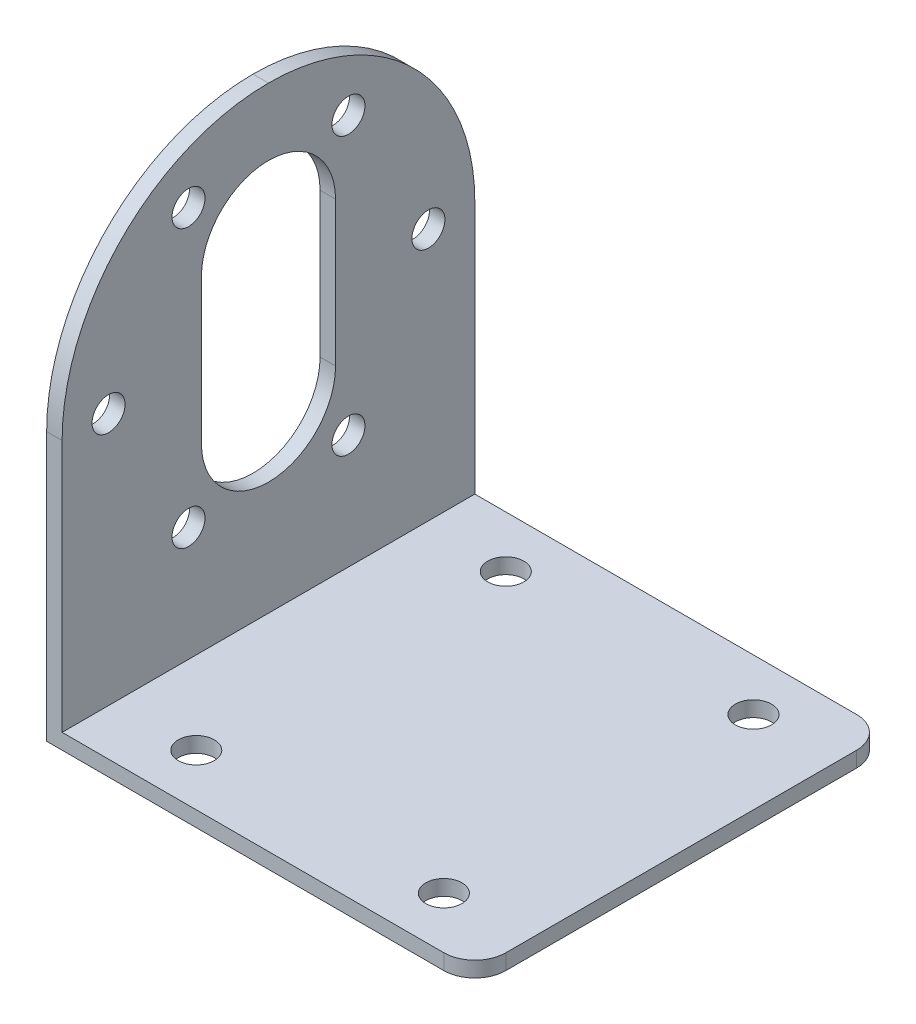
ISO-10303-21;
HEADER;
FILE_DESCRIPTION(('STEP AP214'),'2;1');
FILE_NAME('part.step','',(''),(''),'','','');
FILE_SCHEMA(('AUTOMOTIVE_DESIGN { 1 0 10303 214 1 1 1 1 }'));
ENDSEC;
DATA;
#1=APPLICATION_CONTEXT('core data for automotive mechanical design processes');
#2=APPLICATION_PROTOCOL_DEFINITION('international standard','automotive_design',2000,#1);
#3=PRODUCT_CONTEXT('',#1,'mechanical');
#4=PRODUCT('Part','Part','',(#3));
#5=PRODUCT_RELATED_PRODUCT_CATEGORY('part','',(#4));
#6=PRODUCT_DEFINITION_FORMATION('','',#4);
#7=PRODUCT_DEFINITION_CONTEXT('part definition',#1,'design');
#8=PRODUCT_DEFINITION('design','',#6,#7);
#9=PRODUCT_DEFINITION_SHAPE('','',#8);
#10=(LENGTH_UNIT() NAMED_UNIT(*) SI_UNIT(.MILLI.,.METRE.));
#11=(NAMED_UNIT(*) PLANE_ANGLE_UNIT() SI_UNIT($,.RADIAN.));
#12=(NAMED_UNIT(*) SI_UNIT($,.STERADIAN.) SOLID_ANGLE_UNIT());
#13=UNCERTAINTY_MEASURE_WITH_UNIT(LENGTH_MEASURE(1.E-05),#10,'distance_accuracy_value','');
#14=(GEOMETRIC_REPRESENTATION_CONTEXT(3) GLOBAL_UNCERTAINTY_ASSIGNED_CONTEXT((#13)) GLOBAL_UNIT_ASSIGNED_CONTEXT((#10,
#11,#12)) REPRESENTATION_CONTEXT('',''));
#15=CARTESIAN_POINT('',(0.,0.,0.));
#16=DIRECTION('',(0.,0.,1.));
#17=DIRECTION('',(1.,0.,0.));
#18=AXIS2_PLACEMENT_3D('',#15,#16,#17);
#19=CARTESIAN_POINT('',(0.,1.5,0.));
#20=DIRECTION('',(0.,-1.,0.));
#21=DIRECTION('',(0.,0.,-1.));
#22=AXIS2_PLACEMENT_3D('',#19,#20,#21);
#23=PLANE('',#22);
#24=CARTESIAN_POINT('',(12.75,1.5,-15.));
#25=DIRECTION('',(0.,1.,0.));
#26=DIRECTION('',(0.,0.,1.));
#27=AXIS2_PLACEMENT_3D('',#24,#25,#26);
#28=CIRCLE('',#27,1.75);
#29=CARTESIAN_POINT('',(12.75,1.5,-13.25));
#30=VERTEX_POINT('',#29);
#31=EDGE_CURVE('E212',#30,#30,#28,.T.);
#32=ORIENTED_EDGE('',*,*,#31,.F.);
#33=EDGE_LOOP('',(#32));
#34=FACE_BOUND('',#33,.T.);
#35=CARTESIAN_POINT('',(-11.25,1.5,15.));
#36=DIRECTION('',(0.,1.,0.));
#37=DIRECTION('',(0.,0.,1.));
#38=AXIS2_PLACEMENT_3D('',#35,#36,#37);
#39=CIRCLE('',#38,1.75);
#40=CARTESIAN_POINT('',(-11.25,1.5,16.75));
#41=VERTEX_POINT('',#40);
#42=EDGE_CURVE('E201',#41,#41,#39,.T.);
#43=ORIENTED_EDGE('',*,*,#42,.F.);
#44=EDGE_LOOP('',(#43));
#45=FACE_BOUND('',#44,.T.);
#46=CARTESIAN_POINT('',(12.75,1.5,15.));
#47=DIRECTION('',(0.,1.,0.));
#48=DIRECTION('',(0.,0.,1.));
#49=AXIS2_PLACEMENT_3D('',#46,#47,#48);
#50=CIRCLE('',#49,1.75);
#51=CARTESIAN_POINT('',(12.75,1.5,16.75));
#52=VERTEX_POINT('',#51);
#53=EDGE_CURVE('E202',#52,#52,#50,.T.);
#54=ORIENTED_EDGE('',*,*,#53,.F.);
#55=EDGE_LOOP('',(#54));
#56=FACE_BOUND('',#55,.T.);
#57=CARTESIAN_POINT('',(-11.25,1.5,-15.));
#58=DIRECTION('',(0.,1.,0.));
#59=DIRECTION('',(0.,0.,1.));
#60=AXIS2_PLACEMENT_3D('',#57,#58,#59);
#61=CIRCLE('',#60,1.75);
#62=CARTESIAN_POINT('',(-11.25,1.5,-13.25));
#63=VERTEX_POINT('',#62);
#64=EDGE_CURVE('E211',#63,#63,#61,.T.);
#65=ORIENTED_EDGE('',*,*,#64,.F.);
#66=EDGE_LOOP('',(#65));
#67=FACE_BOUND('',#66,.T.);
#68=DIRECTION('',(0.,0.,-1.));
#69=VECTOR('',#68,1.);
#70=CARTESIAN_POINT('',(20.75,1.5,20.));
#71=LINE('',#70,#69);
#72=CARTESIAN_POINT('',(20.75,1.5,17.));
#73=VERTEX_POINT('',#72);
#74=CARTESIAN_POINT('',(20.75,1.5,-17.));
#75=VERTEX_POINT('',#74);
#76=EDGE_CURVE('E242',#73,#75,#71,.T.);
#77=ORIENTED_EDGE('',*,*,#76,.T.);
#78=CARTESIAN_POINT('',(17.75,1.5,-17.));
#79=DIRECTION('',(0.,-1.,0.));
#80=DIRECTION('',(0.,0.,-1.));
#81=AXIS2_PLACEMENT_3D('',#78,#79,#80);
#82=CIRCLE('',#81,3.);
#83=CARTESIAN_POINT('',(17.75,1.5,-20.));
#84=VERTEX_POINT('',#83);
#85=EDGE_CURVE('E48',#75,#84,#82,.F.);
#86=ORIENTED_EDGE('',*,*,#85,.T.);
#87=DIRECTION('',(-1.,0.,0.));
#88=VECTOR('',#87,1.);
#89=CARTESIAN_POINT('',(-20.75,1.5,-20.));
#90=LINE('',#89,#88);
#91=CARTESIAN_POINT('',(-19.25,1.5,-20.));
#92=VERTEX_POINT('',#91);
#93=EDGE_CURVE('E245',#84,#92,#90,.T.);
#94=ORIENTED_EDGE('',*,*,#93,.T.);
#95=DIRECTION('',(0.,0.,-1.));
#96=VECTOR('',#95,1.);
#97=CARTESIAN_POINT('',(-19.25,1.5,-20.));
#98=LINE('',#97,#96);
#99=CARTESIAN_POINT('',(-19.25,1.5,20.));
#100=VERTEX_POINT('',#99);
#101=EDGE_CURVE('E227',#100,#92,#98,.T.);
#102=ORIENTED_EDGE('',*,*,#101,.F.);
#103=DIRECTION('',(1.,0.,0.));
#104=VECTOR('',#103,1.);
#105=CARTESIAN_POINT('',(-20.75,1.5,20.));
#106=LINE('',#105,#104);
#107=CARTESIAN_POINT('',(17.75,1.5,20.));
#108=VERTEX_POINT('',#107);
#109=EDGE_CURVE('E249',#100,#108,#106,.T.);
#110=ORIENTED_EDGE('',*,*,#109,.T.);
#111=CARTESIAN_POINT('',(17.75,1.5,17.));
#112=DIRECTION('',(0.,-1.,0.));
#113=DIRECTION('',(0.,0.,-1.));
#114=AXIS2_PLACEMENT_3D('',#111,#112,#113);
#115=CIRCLE('',#114,3.);
#116=EDGE_CURVE('E310',#108,#73,#115,.F.);
#117=ORIENTED_EDGE('',*,*,#116,.T.);
#118=EDGE_LOOP('',(#77,#86,#94,#102,#110,#117));
#119=FACE_BOUND('',#118,.T.);
#120=ADVANCED_FACE('F39',(#34,#45,#56,#67,#119),#23,.F.);
#121=CARTESIAN_POINT('',(20.75,1.5,20.));
#122=DIRECTION('',(-1.,0.,0.));
#123=DIRECTION('',(0.,0.,1.));
#124=AXIS2_PLACEMENT_3D('',#121,#122,#123);
#125=PLANE('',#124);
#126=DIRECTION('',(0.,0.,-1.));
#127=VECTOR('',#126,1.);
#128=CARTESIAN_POINT('',(20.75,0.,20.));
#129=LINE('',#128,#127);
#130=CARTESIAN_POINT('',(20.75,0.,17.));
#131=VERTEX_POINT('',#130);
#132=CARTESIAN_POINT('',(20.75,0.,-17.));
#133=VERTEX_POINT('',#132);
#134=EDGE_CURVE('E241',#131,#133,#129,.T.);
#135=ORIENTED_EDGE('',*,*,#134,.T.);
#136=DIRECTION('',(0.,-1.,0.));
#137=VECTOR('',#136,1.);
#138=CARTESIAN_POINT('',(20.75,1.5,-17.));
#139=LINE('',#138,#137);
#140=EDGE_CURVE('E61',#133,#75,#139,.F.);
#141=ORIENTED_EDGE('',*,*,#140,.T.);
#142=ORIENTED_EDGE('',*,*,#76,.F.);
#143=DIRECTION('',(0.,-1.,0.));
#144=VECTOR('',#143,1.);
#145=CARTESIAN_POINT('',(20.75,1.5,17.));
#146=LINE('',#145,#144);
#147=EDGE_CURVE('E304',#73,#131,#146,.T.);
#148=ORIENTED_EDGE('',*,*,#147,.T.);
#149=EDGE_LOOP('',(#135,#141,#142,#148));
#150=FACE_BOUND('',#149,.T.);
#151=ADVANCED_FACE('F328',(#150),#125,.F.);
#152=CARTESIAN_POINT('',(-20.75,1.5,-20.));
#153=DIRECTION('',(0.,0.,1.));
#154=DIRECTION('',(1.,0.,0.));
#155=AXIS2_PLACEMENT_3D('',#152,#153,#154);
#156=PLANE('',#155);
#157=ORIENTED_EDGE('',*,*,#93,.F.);
#158=DIRECTION('',(0.,-1.,0.));
#159=VECTOR('',#158,1.);
#160=CARTESIAN_POINT('',(17.75,1.5,-20.));
#161=LINE('',#160,#159);
#162=CARTESIAN_POINT('',(17.75,0.,-20.));
#163=VERTEX_POINT('',#162);
#164=EDGE_CURVE('E289',#84,#163,#161,.T.);
#165=ORIENTED_EDGE('',*,*,#164,.T.);
#166=DIRECTION('',(-1.,0.,0.));
#167=VECTOR('',#166,1.);
#168=CARTESIAN_POINT('',(-20.75,0.,-20.));
#169=LINE('',#168,#167);
#170=CARTESIAN_POINT('',(-20.75,0.,-20.));
#171=VERTEX_POINT('',#170);
#172=EDGE_CURVE('E255',#163,#171,#169,.T.);
#173=ORIENTED_EDGE('',*,*,#172,.T.);
#174=DIRECTION('',(0.,-1.,0.));
#175=VECTOR('',#174,1.);
#176=CARTESIAN_POINT('',(-20.75,1.5,-20.));
#177=LINE('',#176,#175);
#178=CARTESIAN_POINT('',(-20.75,26.,-20.));
#179=VERTEX_POINT('',#178);
#180=EDGE_CURVE('E266',#179,#171,#177,.T.);
#181=ORIENTED_EDGE('',*,*,#180,.F.);
#182=DIRECTION('',(-1.,0.,0.));
#183=VECTOR('',#182,1.);
#184=CARTESIAN_POINT('',(-19.25,26.,-20.));
#185=LINE('',#184,#183);
#186=CARTESIAN_POINT('',(-19.25,26.,-20.));
#187=VERTEX_POINT('',#186);
#188=EDGE_CURVE('E276',#179,#187,#185,.F.);
#189=ORIENTED_EDGE('',*,*,#188,.T.);
#190=DIRECTION('',(0.,-1.,0.));
#191=VECTOR('',#190,1.);
#192=CARTESIAN_POINT('',(-19.25,46.,-20.));
#193=LINE('',#192,#191);
#194=EDGE_CURVE('E234',#187,#92,#193,.T.);
#195=ORIENTED_EDGE('',*,*,#194,.T.);
#196=EDGE_LOOP('',(#157,#165,#173,#181,#189,#195));
#197=FACE_BOUND('',#196,.T.);
#198=ADVANCED_FACE('F320',(#197),#156,.F.);
#199=CARTESIAN_POINT('',(-20.75,1.5,20.));
#200=DIRECTION('',(1.,0.,0.));
#201=DIRECTION('',(0.,0.,-1.));
#202=AXIS2_PLACEMENT_3D('',#199,#200,#201);
#203=PLANE('',#202);
#204=CARTESIAN_POINT('',(-20.75,26.,15.5));
#205=DIRECTION('',(1.,0.,0.));
#206=DIRECTION('',(0.,0.,-1.));
#207=AXIS2_PLACEMENT_3D('',#204,#205,#206);
#208=CIRCLE('',#207,1.6);
#209=CARTESIAN_POINT('',(-20.75,26.,13.9));
#210=VERTEX_POINT('',#209);
#211=EDGE_CURVE('E206',#210,#210,#208,.T.);
#212=ORIENTED_EDGE('',*,*,#211,.T.);
#213=EDGE_LOOP('',(#212));
#214=FACE_BOUND('',#213,.T.);
#215=CARTESIAN_POINT('',(-20.75,12.5766062413413,7.75000000000016));
#216=DIRECTION('',(1.,0.,0.));
#217=DIRECTION('',(0.,0.,-1.));
#218=AXIS2_PLACEMENT_3D('',#215,#216,#217);
#219=CIRCLE('',#218,1.6);
#220=CARTESIAN_POINT('',(-20.75,12.5766062413413,6.15000000000016));
#221=VERTEX_POINT('',#220);
#222=EDGE_CURVE('E590',#221,#221,#219,.T.);
#223=ORIENTED_EDGE('',*,*,#222,.T.);
#224=EDGE_LOOP('',(#223));
#225=FACE_BOUND('',#224,.T.);
#226=CARTESIAN_POINT('',(-20.75,12.5766062413411,-7.74999999999987));
#227=DIRECTION('',(1.,0.,0.));
#228=DIRECTION('',(0.,0.,-1.));
#229=AXIS2_PLACEMENT_3D('',#226,#227,#228);
#230=CIRCLE('',#229,1.6);
#231=CARTESIAN_POINT('',(-20.75,12.5766062413411,-9.34999999999987));
#232=VERTEX_POINT('',#231);
#233=EDGE_CURVE('E616',#232,#232,#230,.T.);
#234=ORIENTED_EDGE('',*,*,#233,.T.);
#235=EDGE_LOOP('',(#234));
#236=FACE_BOUND('',#235,.T.);
#237=CARTESIAN_POINT('',(-20.75,39.4233937586588,7.74999999999997));
#238=DIRECTION('',(1.,0.,0.));
#239=DIRECTION('',(0.,0.,-1.));
#240=AXIS2_PLACEMENT_3D('',#237,#238,#239);
#241=CIRCLE('',#240,1.6);
#242=CARTESIAN_POINT('',(-20.75,39.4233937586588,6.14999999999997));
#243=VERTEX_POINT('',#242);
#244=EDGE_CURVE('E182',#243,#243,#241,.T.);
#245=ORIENTED_EDGE('',*,*,#244,.T.);
#246=EDGE_LOOP('',(#245));
#247=FACE_BOUND('',#246,.T.);
#248=DIRECTION('',(0.,1.,0.));
#249=VECTOR('',#248,1.);
#250=CARTESIAN_POINT('',(-20.75,33.,-6.5));
#251=LINE('',#250,#249);
#252=CARTESIAN_POINT('',(-20.75,19.,-6.5));
#253=VERTEX_POINT('',#252);
#254=CARTESIAN_POINT('',(-20.75,33.,-6.5));
#255=VERTEX_POINT('',#254);
#256=EDGE_CURVE('E150',#253,#255,#251,.T.);
#257=ORIENTED_EDGE('',*,*,#256,.T.);
#258=CARTESIAN_POINT('',(-20.75,33.,0.));
#259=DIRECTION('',(1.,0.,0.));
#260=DIRECTION('',(0.,0.,-1.));
#261=AXIS2_PLACEMENT_3D('',#258,#259,#260);
#262=CIRCLE('',#261,6.5);
#263=CARTESIAN_POINT('',(-20.75,33.,6.5));
#264=VERTEX_POINT('',#263);
#265=EDGE_CURVE('E141',#255,#264,#262,.T.);
#266=ORIENTED_EDGE('',*,*,#265,.T.);
#267=DIRECTION('',(0.,-1.,0.));
#268=VECTOR('',#267,1.);
#269=CARTESIAN_POINT('',(-20.75,33.,6.5));
#270=LINE('',#269,#268);
#271=CARTESIAN_POINT('',(-20.75,19.,6.5));
#272=VERTEX_POINT('',#271);
#273=EDGE_CURVE('E154',#264,#272,#270,.T.);
#274=ORIENTED_EDGE('',*,*,#273,.T.);
#275=CARTESIAN_POINT('',(-20.75,19.,0.));
#276=DIRECTION('',(1.,0.,0.));
#277=DIRECTION('',(0.,0.,-1.));
#278=AXIS2_PLACEMENT_3D('',#275,#276,#277);
#279=CIRCLE('',#278,6.5);
#280=EDGE_CURVE('E159',#272,#253,#279,.T.);
#281=ORIENTED_EDGE('',*,*,#280,.T.);
#282=EDGE_LOOP('',(#257,#266,#274,#281));
#283=FACE_BOUND('',#282,.T.);
#284=CARTESIAN_POINT('',(-20.75,39.4233937586588,-7.75000000000006));
#285=DIRECTION('',(1.,0.,0.));
#286=DIRECTION('',(0.,0.,-1.));
#287=AXIS2_PLACEMENT_3D('',#284,#285,#286);
#288=CIRCLE('',#287,1.6);
#289=CARTESIAN_POINT('',(-20.75,39.4233937586588,-9.35000000000006));
#290=VERTEX_POINT('',#289);
#291=EDGE_CURVE('E601',#290,#290,#288,.T.);
#292=ORIENTED_EDGE('',*,*,#291,.T.);
#293=EDGE_LOOP('',(#292));
#294=FACE_BOUND('',#293,.T.);
#295=CARTESIAN_POINT('',(-20.75,25.9999999999999,-15.5));
#296=DIRECTION('',(1.,0.,0.));
#297=DIRECTION('',(0.,0.,-1.));
#298=AXIS2_PLACEMENT_3D('',#295,#296,#297);
#299=CIRCLE('',#298,1.6);
#300=CARTESIAN_POINT('',(-20.75,25.9999999999999,-17.1));
#301=VERTEX_POINT('',#300);
#302=EDGE_CURVE('E609',#301,#301,#299,.T.);
#303=ORIENTED_EDGE('',*,*,#302,.T.);
#304=EDGE_LOOP('',(#303));
#305=FACE_BOUND('',#304,.T.);
#306=CARTESIAN_POINT('',(-20.75,26.,0.));
#307=DIRECTION('',(1.,0.,0.));
#308=DIRECTION('',(0.,0.,-1.));
#309=AXIS2_PLACEMENT_3D('',#306,#307,#308);
#310=CIRCLE('',#309,20.);
#311=CARTESIAN_POINT('',(-20.75,26.,20.));
#312=VERTEX_POINT('',#311);
#313=CARTESIAN_POINT('',(-20.75,46.,0.));
#314=VERTEX_POINT('',#313);
#315=EDGE_CURVE('E270',#312,#314,#310,.F.);
#316=ORIENTED_EDGE('',*,*,#315,.T.);
#317=CARTESIAN_POINT('',(-20.75,26.,0.));
#318=DIRECTION('',(1.,0.,0.));
#319=DIRECTION('',(0.,0.,-1.));
#320=AXIS2_PLACEMENT_3D('',#317,#318,#319);
#321=CIRCLE('',#320,20.);
#322=EDGE_CURVE('E273',#314,#179,#321,.F.);
#323=ORIENTED_EDGE('',*,*,#322,.T.);
#324=ORIENTED_EDGE('',*,*,#180,.T.);
#325=DIRECTION('',(0.,0.,1.));
#326=VECTOR('',#325,1.);
#327=CARTESIAN_POINT('',(-20.75,0.,20.));
#328=LINE('',#327,#326);
#329=CARTESIAN_POINT('',(-20.75,0.,20.));
#330=VERTEX_POINT('',#329);
#331=EDGE_CURVE('E258',#171,#330,#328,.T.);
#332=ORIENTED_EDGE('',*,*,#331,.T.);
#333=DIRECTION('',(0.,-1.,0.));
#334=VECTOR('',#333,1.);
#335=CARTESIAN_POINT('',(-20.75,1.5,20.));
#336=LINE('',#335,#334);
#337=EDGE_CURVE('E252',#312,#330,#336,.T.);
#338=ORIENTED_EDGE('',*,*,#337,.F.);
#339=EDGE_LOOP('',(#316,#323,#324,#332,#338));
#340=FACE_BOUND('',#339,.T.);
#341=ADVANCED_FACE('F161',(#214,#225,#236,#247,#283,#294,#305,#340),#203,.F.);
#342=CARTESIAN_POINT('',(-20.75,1.5,20.));
#343=DIRECTION('',(0.,0.,-1.));
#344=DIRECTION('',(-1.,0.,0.));
#345=AXIS2_PLACEMENT_3D('',#342,#343,#344);
#346=PLANE('',#345);
#347=DIRECTION('',(1.,0.,0.));
#348=VECTOR('',#347,1.);
#349=CARTESIAN_POINT('',(-20.75,0.,20.));
#350=LINE('',#349,#348);
#351=CARTESIAN_POINT('',(17.75,0.,20.));
#352=VERTEX_POINT('',#351);
#353=EDGE_CURVE('E246',#330,#352,#350,.T.);
#354=ORIENTED_EDGE('',*,*,#353,.T.);
#355=DIRECTION('',(0.,-1.,0.));
#356=VECTOR('',#355,1.);
#357=CARTESIAN_POINT('',(17.75,1.5,20.));
#358=LINE('',#357,#356);
#359=EDGE_CURVE('E11',#352,#108,#358,.F.);
#360=ORIENTED_EDGE('',*,*,#359,.T.);
#361=ORIENTED_EDGE('',*,*,#109,.F.);
#362=DIRECTION('',(0.,-1.,0.));
#363=VECTOR('',#362,1.);
#364=CARTESIAN_POINT('',(-19.25,46.,20.));
#365=LINE('',#364,#363);
#366=CARTESIAN_POINT('',(-19.25,26.,20.));
#367=VERTEX_POINT('',#366);
#368=EDGE_CURVE('E238',#367,#100,#365,.T.);
#369=ORIENTED_EDGE('',*,*,#368,.F.);
#370=DIRECTION('',(1.,0.,0.));
#371=VECTOR('',#370,1.);
#372=CARTESIAN_POINT('',(-20.75,26.,20.));
#373=LINE('',#372,#371);
#374=EDGE_CURVE('E286',#367,#312,#373,.F.);
#375=ORIENTED_EDGE('',*,*,#374,.T.);
#376=ORIENTED_EDGE('',*,*,#337,.T.);
#377=EDGE_LOOP('',(#354,#360,#361,#369,#375,#376));
#378=FACE_BOUND('',#377,.T.);
#379=ADVANCED_FACE('F333',(#378),#346,.F.);
#380=CARTESIAN_POINT('',(0.,0.,0.));
#381=DIRECTION('',(0.,-1.,0.));
#382=DIRECTION('',(0.,0.,-1.));
#383=AXIS2_PLACEMENT_3D('',#380,#381,#382);
#384=PLANE('',#383);
#385=CARTESIAN_POINT('',(12.75,0.,-15.));
#386=DIRECTION('',(0.,1.,0.));
#387=DIRECTION('',(0.,0.,1.));
#388=AXIS2_PLACEMENT_3D('',#385,#386,#387);
#389=CIRCLE('',#388,1.75);
#390=CARTESIAN_POINT('',(12.75,0.,-13.25));
#391=VERTEX_POINT('',#390);
#392=EDGE_CURVE('E207',#391,#391,#389,.T.);
#393=ORIENTED_EDGE('',*,*,#392,.T.);
#394=EDGE_LOOP('',(#393));
#395=FACE_BOUND('',#394,.T.);
#396=CARTESIAN_POINT('',(-11.25,0.,15.));
#397=DIRECTION('',(0.,1.,0.));
#398=DIRECTION('',(0.,0.,1.));
#399=AXIS2_PLACEMENT_3D('',#396,#397,#398);
#400=CIRCLE('',#399,1.75);
#401=CARTESIAN_POINT('',(-11.25,0.,16.75));
#402=VERTEX_POINT('',#401);
#403=EDGE_CURVE('E216',#402,#402,#400,.T.);
#404=ORIENTED_EDGE('',*,*,#403,.T.);
#405=EDGE_LOOP('',(#404));
#406=FACE_BOUND('',#405,.T.);
#407=CARTESIAN_POINT('',(12.75,0.,15.));
#408=DIRECTION('',(0.,1.,0.));
#409=DIRECTION('',(0.,0.,1.));
#410=AXIS2_PLACEMENT_3D('',#407,#408,#409);
#411=CIRCLE('',#410,1.75);
#412=CARTESIAN_POINT('',(12.75,0.,16.75));
#413=VERTEX_POINT('',#412);
#414=EDGE_CURVE('E197',#413,#413,#411,.T.);
#415=ORIENTED_EDGE('',*,*,#414,.T.);
#416=EDGE_LOOP('',(#415));
#417=FACE_BOUND('',#416,.T.);
#418=CARTESIAN_POINT('',(-11.25,0.,-15.));
#419=DIRECTION('',(0.,1.,0.));
#420=DIRECTION('',(0.,0.,1.));
#421=AXIS2_PLACEMENT_3D('',#418,#419,#420);
#422=CIRCLE('',#421,1.75);
#423=CARTESIAN_POINT('',(-11.25,0.,-13.25));
#424=VERTEX_POINT('',#423);
#425=EDGE_CURVE('E223',#424,#424,#422,.T.);
#426=ORIENTED_EDGE('',*,*,#425,.T.);
#427=EDGE_LOOP('',(#426));
#428=FACE_BOUND('',#427,.T.);
#429=ORIENTED_EDGE('',*,*,#172,.F.);
#430=CARTESIAN_POINT('',(17.75,0.,-17.));
#431=DIRECTION('',(0.,-1.,0.));
#432=DIRECTION('',(0.,0.,-1.));
#433=AXIS2_PLACEMENT_3D('',#430,#431,#432);
#434=CIRCLE('',#433,3.);
#435=EDGE_CURVE('E301',#163,#133,#434,.T.);
#436=ORIENTED_EDGE('',*,*,#435,.T.);
#437=ORIENTED_EDGE('',*,*,#134,.F.);
#438=CARTESIAN_POINT('',(17.75,0.,17.));
#439=DIRECTION('',(0.,-1.,0.));
#440=DIRECTION('',(0.,0.,-1.));
#441=AXIS2_PLACEMENT_3D('',#438,#439,#440);
#442=CIRCLE('',#441,3.);
#443=EDGE_CURVE('E298',#131,#352,#442,.T.);
#444=ORIENTED_EDGE('',*,*,#443,.T.);
#445=ORIENTED_EDGE('',*,*,#353,.F.);
#446=ORIENTED_EDGE('',*,*,#331,.F.);
#447=EDGE_LOOP('',(#429,#436,#437,#444,#445,#446));
#448=FACE_BOUND('',#447,.T.);
#449=ADVANCED_FACE('F326',(#395,#406,#417,#428,#448),#384,.T.);
#450=CARTESIAN_POINT('',(-19.25,46.,-20.));
#451=DIRECTION('',(-1.,0.,0.));
#452=DIRECTION('',(0.,0.,1.));
#453=AXIS2_PLACEMENT_3D('',#450,#451,#452);
#454=PLANE('',#453);
#455=CARTESIAN_POINT('',(-19.25,26.,15.5));
#456=DIRECTION('',(1.,0.,0.));
#457=DIRECTION('',(0.,0.,-1.));
#458=AXIS2_PLACEMENT_3D('',#455,#456,#457);
#459=CIRCLE('',#458,1.6);
#460=CARTESIAN_POINT('',(-19.25,26.,13.9));
#461=VERTEX_POINT('',#460);
#462=EDGE_CURVE('E191',#461,#461,#459,.T.);
#463=ORIENTED_EDGE('',*,*,#462,.F.);
#464=EDGE_LOOP('',(#463));
#465=FACE_BOUND('',#464,.T.);
#466=CARTESIAN_POINT('',(-19.25,12.5766062413413,7.75000000000016));
#467=DIRECTION('',(1.,0.,0.));
#468=DIRECTION('',(0.,0.,-1.));
#469=AXIS2_PLACEMENT_3D('',#466,#467,#468);
#470=CIRCLE('',#469,1.6);
#471=CARTESIAN_POINT('',(-19.25,12.5766062413413,6.15000000000016));
#472=VERTEX_POINT('',#471);
#473=EDGE_CURVE('E294',#472,#472,#470,.T.);
#474=ORIENTED_EDGE('',*,*,#473,.F.);
#475=EDGE_LOOP('',(#474));
#476=FACE_BOUND('',#475,.T.);
#477=CARTESIAN_POINT('',(-19.25,12.5766062413411,-7.74999999999987));
#478=DIRECTION('',(1.,0.,0.));
#479=DIRECTION('',(0.,0.,-1.));
#480=AXIS2_PLACEMENT_3D('',#477,#478,#479);
#481=CIRCLE('',#480,1.6);
#482=CARTESIAN_POINT('',(-19.25,12.5766062413411,-9.34999999999987));
#483=VERTEX_POINT('',#482);
#484=EDGE_CURVE('E597',#483,#483,#481,.T.);
#485=ORIENTED_EDGE('',*,*,#484,.F.);
#486=EDGE_LOOP('',(#485));
#487=FACE_BOUND('',#486,.T.);
#488=CARTESIAN_POINT('',(-19.25,39.4233937586588,7.74999999999997));
#489=DIRECTION('',(1.,0.,0.));
#490=DIRECTION('',(0.,0.,-1.));
#491=AXIS2_PLACEMENT_3D('',#488,#489,#490);
#492=CIRCLE('',#491,1.6);
#493=CARTESIAN_POINT('',(-19.25,39.4233937586588,6.14999999999997));
#494=VERTEX_POINT('',#493);
#495=EDGE_CURVE('E172',#494,#494,#492,.T.);
#496=ORIENTED_EDGE('',*,*,#495,.F.);
#497=EDGE_LOOP('',(#496));
#498=FACE_BOUND('',#497,.T.);
#499=DIRECTION('',(0.,-1.,0.));
#500=VECTOR('',#499,1.);
#501=CARTESIAN_POINT('',(-19.25,33.,6.5));
#502=LINE('',#501,#500);
#503=CARTESIAN_POINT('',(-19.25,33.,6.5));
#504=VERTEX_POINT('',#503);
#505=CARTESIAN_POINT('',(-19.25,19.,6.5));
#506=VERTEX_POINT('',#505);
#507=EDGE_CURVE('E181',#504,#506,#502,.T.);
#508=ORIENTED_EDGE('',*,*,#507,.F.);
#509=CARTESIAN_POINT('',(-19.25,33.,0.));
#510=DIRECTION('',(1.,0.,0.));
#511=DIRECTION('',(0.,0.,-1.));
#512=AXIS2_PLACEMENT_3D('',#509,#510,#511);
#513=CIRCLE('',#512,6.5);
#514=CARTESIAN_POINT('',(-19.25,33.,-6.5));
#515=VERTEX_POINT('',#514);
#516=EDGE_CURVE('E144',#515,#504,#513,.T.);
#517=ORIENTED_EDGE('',*,*,#516,.F.);
#518=DIRECTION('',(0.,1.,0.));
#519=VECTOR('',#518,1.);
#520=CARTESIAN_POINT('',(-19.25,33.,-6.5));
#521=LINE('',#520,#519);
#522=CARTESIAN_POINT('',(-19.25,19.,-6.5));
#523=VERTEX_POINT('',#522);
#524=EDGE_CURVE('E165',#523,#515,#521,.T.);
#525=ORIENTED_EDGE('',*,*,#524,.F.);
#526=CARTESIAN_POINT('',(-19.25,19.,0.));
#527=DIRECTION('',(1.,0.,0.));
#528=DIRECTION('',(0.,0.,-1.));
#529=AXIS2_PLACEMENT_3D('',#526,#527,#528);
#530=CIRCLE('',#529,6.5);
#531=EDGE_CURVE('E169',#506,#523,#530,.T.);
#532=ORIENTED_EDGE('',*,*,#531,.F.);
#533=EDGE_LOOP('',(#508,#517,#525,#532));
#534=FACE_BOUND('',#533,.T.);
#535=CARTESIAN_POINT('',(-19.25,39.4233937586588,-7.75000000000006));
#536=DIRECTION('',(1.,0.,0.));
#537=DIRECTION('',(0.,0.,-1.));
#538=AXIS2_PLACEMENT_3D('',#535,#536,#537);
#539=CIRCLE('',#538,1.6);
#540=CARTESIAN_POINT('',(-19.25,39.4233937586588,-9.35000000000006));
#541=VERTEX_POINT('',#540);
#542=EDGE_CURVE('E605',#541,#541,#539,.T.);
#543=ORIENTED_EDGE('',*,*,#542,.F.);
#544=EDGE_LOOP('',(#543));
#545=FACE_BOUND('',#544,.T.);
#546=CARTESIAN_POINT('',(-19.25,25.9999999999999,-15.5));
#547=DIRECTION('',(1.,0.,0.));
#548=DIRECTION('',(0.,0.,-1.));
#549=AXIS2_PLACEMENT_3D('',#546,#547,#548);
#550=CIRCLE('',#549,1.6);
#551=CARTESIAN_POINT('',(-19.25,25.9999999999999,-17.1));
#552=VERTEX_POINT('',#551);
#553=EDGE_CURVE('E613',#552,#552,#550,.T.);
#554=ORIENTED_EDGE('',*,*,#553,.F.);
#555=EDGE_LOOP('',(#554));
#556=FACE_BOUND('',#555,.T.);
#557=ORIENTED_EDGE('',*,*,#194,.F.);
#558=CARTESIAN_POINT('',(-19.25,26.,0.));
#559=DIRECTION('',(-1.,0.,0.));
#560=DIRECTION('',(0.,0.,1.));
#561=AXIS2_PLACEMENT_3D('',#558,#559,#560);
#562=CIRCLE('',#561,20.);
#563=CARTESIAN_POINT('',(-19.25,46.,0.));
#564=VERTEX_POINT('',#563);
#565=EDGE_CURVE('E283',#187,#564,#562,.F.);
#566=ORIENTED_EDGE('',*,*,#565,.T.);
#567=CARTESIAN_POINT('',(-19.25,26.,0.));
#568=DIRECTION('',(-1.,0.,0.));
#569=DIRECTION('',(0.,0.,1.));
#570=AXIS2_PLACEMENT_3D('',#567,#568,#569);
#571=CIRCLE('',#570,20.);
#572=EDGE_CURVE('E280',#564,#367,#571,.F.);
#573=ORIENTED_EDGE('',*,*,#572,.T.);
#574=ORIENTED_EDGE('',*,*,#368,.T.);
#575=ORIENTED_EDGE('',*,*,#101,.T.);
#576=EDGE_LOOP('',(#557,#566,#573,#574,#575));
#577=FACE_BOUND('',#576,.T.);
#578=ADVANCED_FACE('F347',(#465,#476,#487,#498,#534,#545,#556,#577),#454,.F.);
#579=CARTESIAN_POINT('',(-11.25,0.,-15.));
#580=DIRECTION('',(0.,1.,0.));
#581=DIRECTION('',(0.,0.,1.));
#582=AXIS2_PLACEMENT_3D('',#579,#580,#581);
#583=CYLINDRICAL_SURFACE('',#582,1.75);
#584=ORIENTED_EDGE('',*,*,#425,.F.);
#585=EDGE_LOOP('',(#584));
#586=FACE_BOUND('',#585,.T.);
#587=ORIENTED_EDGE('',*,*,#64,.T.);
#588=EDGE_LOOP('',(#587));
#589=FACE_BOUND('',#588,.T.);
#590=ADVANCED_FACE('F406',(#586,#589),#583,.F.);
#591=CARTESIAN_POINT('',(12.75,0.,15.));
#592=DIRECTION('',(0.,1.,0.));
#593=DIRECTION('',(0.,0.,1.));
#594=AXIS2_PLACEMENT_3D('',#591,#592,#593);
#595=CYLINDRICAL_SURFACE('',#594,1.75);
#596=ORIENTED_EDGE('',*,*,#414,.F.);
#597=EDGE_LOOP('',(#596));
#598=FACE_BOUND('',#597,.T.);
#599=ORIENTED_EDGE('',*,*,#53,.T.);
#600=EDGE_LOOP('',(#599));
#601=FACE_BOUND('',#600,.T.);
#602=ADVANCED_FACE('F413',(#598,#601),#595,.F.);
#603=CARTESIAN_POINT('',(-11.25,0.,15.));
#604=DIRECTION('',(0.,1.,0.));
#605=DIRECTION('',(0.,0.,1.));
#606=AXIS2_PLACEMENT_3D('',#603,#604,#605);
#607=CYLINDRICAL_SURFACE('',#606,1.75);
#608=ORIENTED_EDGE('',*,*,#403,.F.);
#609=EDGE_LOOP('',(#608));
#610=FACE_BOUND('',#609,.T.);
#611=ORIENTED_EDGE('',*,*,#42,.T.);
#612=EDGE_LOOP('',(#611));
#613=FACE_BOUND('',#612,.T.);
#614=ADVANCED_FACE('F420',(#610,#613),#607,.F.);
#615=CARTESIAN_POINT('',(12.75,0.,-15.));
#616=DIRECTION('',(0.,1.,0.));
#617=DIRECTION('',(0.,0.,1.));
#618=AXIS2_PLACEMENT_3D('',#615,#616,#617);
#619=CYLINDRICAL_SURFACE('',#618,1.75);
#620=ORIENTED_EDGE('',*,*,#392,.F.);
#621=EDGE_LOOP('',(#620));
#622=FACE_BOUND('',#621,.T.);
#623=ORIENTED_EDGE('',*,*,#31,.T.);
#624=EDGE_LOOP('',(#623));
#625=FACE_BOUND('',#624,.T.);
#626=ADVANCED_FACE('F428',(#622,#625),#619,.F.);
#627=CARTESIAN_POINT('',(-20.75,25.9999999999999,-15.5));
#628=DIRECTION('',(1.,0.,0.));
#629=DIRECTION('',(0.,0.,-1.));
#630=AXIS2_PLACEMENT_3D('',#627,#628,#629);
#631=CYLINDRICAL_SURFACE('',#630,1.6);
#632=ORIENTED_EDGE('',*,*,#302,.F.);
#633=EDGE_LOOP('',(#632));
#634=FACE_BOUND('',#633,.T.);
#635=ORIENTED_EDGE('',*,*,#553,.T.);
#636=EDGE_LOOP('',(#635));
#637=FACE_BOUND('',#636,.T.);
#638=ADVANCED_FACE('F436',(#634,#637),#631,.F.);
#639=CARTESIAN_POINT('',(-20.75,39.4233937586588,-7.75000000000006));
#640=DIRECTION('',(1.,0.,0.));
#641=DIRECTION('',(0.,0.,-1.));
#642=AXIS2_PLACEMENT_3D('',#639,#640,#641);
#643=CYLINDRICAL_SURFACE('',#642,1.6);
#644=ORIENTED_EDGE('',*,*,#291,.F.);
#645=EDGE_LOOP('',(#644));
#646=FACE_BOUND('',#645,.T.);
#647=ORIENTED_EDGE('',*,*,#542,.T.);
#648=EDGE_LOOP('',(#647));
#649=FACE_BOUND('',#648,.T.);
#650=ADVANCED_FACE('F444',(#646,#649),#643,.F.);
#651=CARTESIAN_POINT('',(-20.75,33.,0.));
#652=DIRECTION('',(1.,0.,0.));
#653=DIRECTION('',(0.,0.,-1.));
#654=AXIS2_PLACEMENT_3D('',#651,#652,#653);
#655=CYLINDRICAL_SURFACE('',#654,6.5);
#656=ORIENTED_EDGE('',*,*,#516,.T.);
#657=DIRECTION('',(1.,0.,0.));
#658=VECTOR('',#657,1.);
#659=CARTESIAN_POINT('',(-20.75,33.,6.5));
#660=LINE('',#659,#658);
#661=EDGE_CURVE('E137',#264,#504,#660,.T.);
#662=ORIENTED_EDGE('',*,*,#661,.F.);
#663=ORIENTED_EDGE('',*,*,#265,.F.);
#664=DIRECTION('',(1.,0.,0.));
#665=VECTOR('',#664,1.);
#666=CARTESIAN_POINT('',(-20.75,33.,-6.5));
#667=LINE('',#666,#665);
#668=EDGE_CURVE('E188',#255,#515,#667,.T.);
#669=ORIENTED_EDGE('',*,*,#668,.T.);
#670=EDGE_LOOP('',(#656,#662,#663,#669));
#671=FACE_BOUND('',#670,.T.);
#672=ADVANCED_FACE('F139',(#671),#655,.F.);
#673=CARTESIAN_POINT('',(-20.75,33.,-6.5));
#674=DIRECTION('',(0.,0.,-1.));
#675=DIRECTION('',(0.,1.,0.));
#676=AXIS2_PLACEMENT_3D('',#673,#674,#675);
#677=PLANE('',#676);
#678=ORIENTED_EDGE('',*,*,#524,.T.);
#679=ORIENTED_EDGE('',*,*,#668,.F.);
#680=ORIENTED_EDGE('',*,*,#256,.F.);
#681=DIRECTION('',(1.,0.,0.));
#682=VECTOR('',#681,1.);
#683=CARTESIAN_POINT('',(-20.75,19.,-6.5));
#684=LINE('',#683,#682);
#685=EDGE_CURVE('E192',#253,#523,#684,.T.);
#686=ORIENTED_EDGE('',*,*,#685,.T.);
#687=EDGE_LOOP('',(#678,#679,#680,#686));
#688=FACE_BOUND('',#687,.T.);
#689=ADVANCED_FACE('F459',(#688),#677,.F.);
#690=CARTESIAN_POINT('',(-20.75,19.,0.));
#691=DIRECTION('',(1.,0.,0.));
#692=DIRECTION('',(0.,0.,-1.));
#693=AXIS2_PLACEMENT_3D('',#690,#691,#692);
#694=CYLINDRICAL_SURFACE('',#693,6.5);
#695=ORIENTED_EDGE('',*,*,#531,.T.);
#696=ORIENTED_EDGE('',*,*,#685,.F.);
#697=ORIENTED_EDGE('',*,*,#280,.F.);
#698=DIRECTION('',(1.,0.,0.));
#699=VECTOR('',#698,1.);
#700=CARTESIAN_POINT('',(-20.75,19.,6.5));
#701=LINE('',#700,#699);
#702=EDGE_CURVE('E149',#272,#506,#701,.T.);
#703=ORIENTED_EDGE('',*,*,#702,.T.);
#704=EDGE_LOOP('',(#695,#696,#697,#703));
#705=FACE_BOUND('',#704,.T.);
#706=ADVANCED_FACE('F466',(#705),#694,.F.);
#707=CARTESIAN_POINT('',(-20.75,33.,6.5));
#708=DIRECTION('',(0.,0.,1.));
#709=DIRECTION('',(0.,-1.,0.));
#710=AXIS2_PLACEMENT_3D('',#707,#708,#709);
#711=PLANE('',#710);
#712=ORIENTED_EDGE('',*,*,#507,.T.);
#713=ORIENTED_EDGE('',*,*,#702,.F.);
#714=ORIENTED_EDGE('',*,*,#273,.F.);
#715=ORIENTED_EDGE('',*,*,#661,.T.);
#716=EDGE_LOOP('',(#712,#713,#714,#715));
#717=FACE_BOUND('',#716,.T.);
#718=ADVANCED_FACE('F155',(#717),#711,.F.);
#719=CARTESIAN_POINT('',(-20.75,39.4233937586588,7.74999999999997));
#720=DIRECTION('',(1.,0.,0.));
#721=DIRECTION('',(0.,0.,-1.));
#722=AXIS2_PLACEMENT_3D('',#719,#720,#721);
#723=CYLINDRICAL_SURFACE('',#722,1.6);
#724=ORIENTED_EDGE('',*,*,#244,.F.);
#725=EDGE_LOOP('',(#724));
#726=FACE_BOUND('',#725,.T.);
#727=ORIENTED_EDGE('',*,*,#495,.T.);
#728=EDGE_LOOP('',(#727));
#729=FACE_BOUND('',#728,.T.);
#730=ADVANCED_FACE('F481',(#726,#729),#723,.F.);
#731=CARTESIAN_POINT('',(-20.75,12.5766062413411,-7.74999999999987));
#732=DIRECTION('',(1.,0.,0.));
#733=DIRECTION('',(0.,0.,-1.));
#734=AXIS2_PLACEMENT_3D('',#731,#732,#733);
#735=CYLINDRICAL_SURFACE('',#734,1.6);
#736=ORIENTED_EDGE('',*,*,#233,.F.);
#737=EDGE_LOOP('',(#736));
#738=FACE_BOUND('',#737,.T.);
#739=ORIENTED_EDGE('',*,*,#484,.T.);
#740=EDGE_LOOP('',(#739));
#741=FACE_BOUND('',#740,.T.);
#742=ADVANCED_FACE('F488',(#738,#741),#735,.F.);
#743=CARTESIAN_POINT('',(-20.75,12.5766062413413,7.75000000000016));
#744=DIRECTION('',(1.,0.,0.));
#745=DIRECTION('',(0.,0.,-1.));
#746=AXIS2_PLACEMENT_3D('',#743,#744,#745);
#747=CYLINDRICAL_SURFACE('',#746,1.6);
#748=ORIENTED_EDGE('',*,*,#222,.F.);
#749=EDGE_LOOP('',(#748));
#750=FACE_BOUND('',#749,.T.);
#751=ORIENTED_EDGE('',*,*,#473,.T.);
#752=EDGE_LOOP('',(#751));
#753=FACE_BOUND('',#752,.T.);
#754=ADVANCED_FACE('F358',(#750,#753),#747,.F.);
#755=CARTESIAN_POINT('',(-20.75,26.,15.5));
#756=DIRECTION('',(1.,0.,0.));
#757=DIRECTION('',(0.,0.,-1.));
#758=AXIS2_PLACEMENT_3D('',#755,#756,#757);
#759=CYLINDRICAL_SURFACE('',#758,1.6);
#760=ORIENTED_EDGE('',*,*,#211,.F.);
#761=EDGE_LOOP('',(#760));
#762=FACE_BOUND('',#761,.T.);
#763=ORIENTED_EDGE('',*,*,#462,.T.);
#764=EDGE_LOOP('',(#763));
#765=FACE_BOUND('',#764,.T.);
#766=ADVANCED_FACE('F351',(#762,#765),#759,.F.);
#767=CARTESIAN_POINT('',(0.,26.,0.));
#768=DIRECTION('',(-1.,0.,0.));
#769=DIRECTION('',(0.,0.,1.));
#770=AXIS2_PLACEMENT_3D('',#767,#768,#769);
#771=CYLINDRICAL_SURFACE('',#770,20.);
#772=ORIENTED_EDGE('',*,*,#374,.F.);
#773=ORIENTED_EDGE('',*,*,#572,.F.);
#774=DIRECTION('',(1.,0.,0.));
#775=VECTOR('',#774,1.);
#776=CARTESIAN_POINT('',(-19.25,46.,0.));
#777=LINE('',#776,#775);
#778=EDGE_CURVE('E290',#314,#564,#777,.T.);
#779=ORIENTED_EDGE('',*,*,#778,.F.);
#780=ORIENTED_EDGE('',*,*,#315,.F.);
#781=EDGE_LOOP('',(#772,#773,#779,#780));
#782=FACE_BOUND('',#781,.T.);
#783=ADVANCED_FACE('F349',(#782),#771,.T.);
#784=CARTESIAN_POINT('',(0.,26.,0.));
#785=DIRECTION('',(1.,0.,0.));
#786=DIRECTION('',(0.,0.,-1.));
#787=AXIS2_PLACEMENT_3D('',#784,#785,#786);
#788=CYLINDRICAL_SURFACE('',#787,20.);
#789=ORIENTED_EDGE('',*,*,#565,.F.);
#790=ORIENTED_EDGE('',*,*,#188,.F.);
#791=ORIENTED_EDGE('',*,*,#322,.F.);
#792=ORIENTED_EDGE('',*,*,#778,.T.);
#793=EDGE_LOOP('',(#789,#790,#791,#792));
#794=FACE_BOUND('',#793,.T.);
#795=ADVANCED_FACE('F343',(#794),#788,.T.);
#796=CARTESIAN_POINT('',(17.75,1.5,-17.));
#797=DIRECTION('',(0.,-1.,0.));
#798=DIRECTION('',(0.,0.,-1.));
#799=AXIS2_PLACEMENT_3D('',#796,#797,#798);
#800=CYLINDRICAL_SURFACE('',#799,3.);
#801=ORIENTED_EDGE('',*,*,#85,.F.);
#802=ORIENTED_EDGE('',*,*,#140,.F.);
#803=ORIENTED_EDGE('',*,*,#435,.F.);
#804=ORIENTED_EDGE('',*,*,#164,.F.);
#805=EDGE_LOOP('',(#801,#802,#803,#804));
#806=FACE_BOUND('',#805,.T.);
#807=ADVANCED_FACE('F323',(#806),#800,.T.);
#808=CARTESIAN_POINT('',(17.75,1.5,17.));
#809=DIRECTION('',(0.,-1.,0.));
#810=DIRECTION('',(0.,0.,-1.));
#811=AXIS2_PLACEMENT_3D('',#808,#809,#810);
#812=CYLINDRICAL_SURFACE('',#811,3.);
#813=ORIENTED_EDGE('',*,*,#116,.F.);
#814=ORIENTED_EDGE('',*,*,#359,.F.);
#815=ORIENTED_EDGE('',*,*,#443,.F.);
#816=ORIENTED_EDGE('',*,*,#147,.F.);
#817=EDGE_LOOP('',(#813,#814,#815,#816));
#818=FACE_BOUND('',#817,.T.);
#819=ADVANCED_FACE('F41',(#818),#812,.T.);
#820=CLOSED_SHELL('',(#120,#151,#198,#341,#379,#449,#578,#590,#602,#614,#626,#638,#650,#672,
#689,#706,#718,#730,#742,#754,#766,#783,#795,#807,#819));
#821=MANIFOLD_SOLID_BREP('B2',#820);
#822=ADVANCED_BREP_SHAPE_REPRESENTATION('',(#18,#821),#14);
#823=SHAPE_DEFINITION_REPRESENTATION(#9,#822);
ENDSEC;
END-ISO-10303-21;
